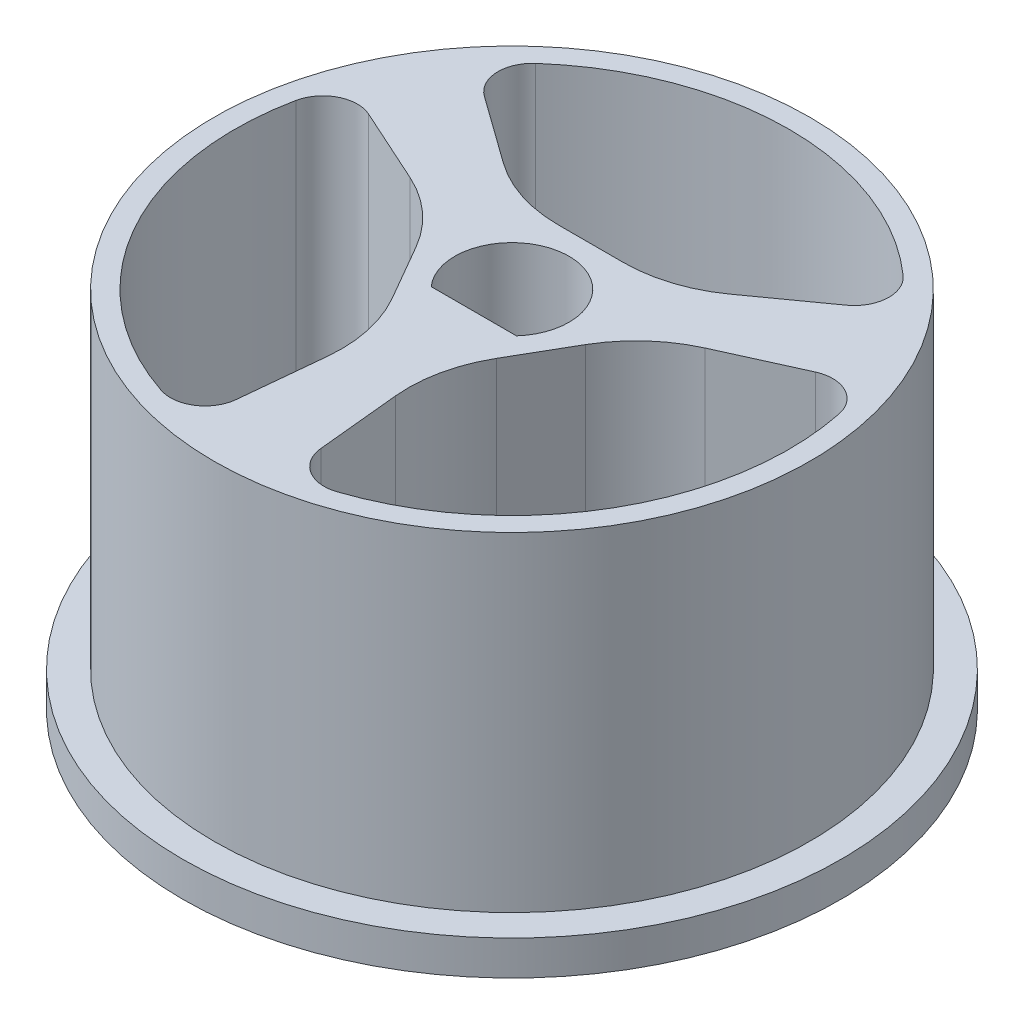
ISO-10303-21;
HEADER;
FILE_DESCRIPTION(('STEP AP214'),'2;1');
FILE_NAME('part.step','',(''),(''),'','','');
FILE_SCHEMA(('AUTOMOTIVE_DESIGN { 1 0 10303 214 1 1 1 1 }'));
ENDSEC;
DATA;
#1=APPLICATION_CONTEXT('core data for automotive mechanical design processes');
#2=APPLICATION_PROTOCOL_DEFINITION('international standard','automotive_design',2000,#1);
#3=PRODUCT_CONTEXT('',#1,'mechanical');
#4=PRODUCT('Part','Part','',(#3));
#5=PRODUCT_RELATED_PRODUCT_CATEGORY('part','',(#4));
#6=PRODUCT_DEFINITION_FORMATION('','',#4);
#7=PRODUCT_DEFINITION_CONTEXT('part definition',#1,'design');
#8=PRODUCT_DEFINITION('design','',#6,#7);
#9=PRODUCT_DEFINITION_SHAPE('','',#8);
#10=(LENGTH_UNIT() NAMED_UNIT(*) SI_UNIT(.MILLI.,.METRE.));
#11=(NAMED_UNIT(*) PLANE_ANGLE_UNIT() SI_UNIT($,.RADIAN.));
#12=(NAMED_UNIT(*) SI_UNIT($,.STERADIAN.) SOLID_ANGLE_UNIT());
#13=UNCERTAINTY_MEASURE_WITH_UNIT(LENGTH_MEASURE(1.E-05),#10,'distance_accuracy_value','');
#14=(GEOMETRIC_REPRESENTATION_CONTEXT(3) GLOBAL_UNCERTAINTY_ASSIGNED_CONTEXT((#13)) GLOBAL_UNIT_ASSIGNED_CONTEXT((#10,
#11,#12)) REPRESENTATION_CONTEXT('',''));
#15=CARTESIAN_POINT('',(0.,0.,0.));
#16=DIRECTION('',(0.,0.,1.));
#17=DIRECTION('',(1.,0.,0.));
#18=AXIS2_PLACEMENT_3D('',#15,#16,#17);
#19=CARTESIAN_POINT('',(0.,1.,0.));
#20=DIRECTION('',(0.,-1.,0.));
#21=DIRECTION('',(0.,0.,-1.));
#22=AXIS2_PLACEMENT_3D('',#19,#20,#21);
#23=CYLINDRICAL_SURFACE('',#22,9.5);
#24=CARTESIAN_POINT('',(0.,1.,0.));
#25=DIRECTION('',(0.,1.,0.));
#26=DIRECTION('',(0.,0.,1.));
#27=AXIS2_PLACEMENT_3D('',#24,#25,#26);
#28=CIRCLE('',#27,9.5);
#29=CARTESIAN_POINT('',(0.,1.,9.5));
#30=VERTEX_POINT('',#29);
#31=EDGE_CURVE('E11',#30,#30,#28,.T.);
#32=ORIENTED_EDGE('',*,*,#31,.F.);
#33=EDGE_LOOP('',(#32));
#34=FACE_BOUND('',#33,.T.);
#35=CARTESIAN_POINT('',(0.,0.,0.));
#36=DIRECTION('',(0.,1.,0.));
#37=DIRECTION('',(0.,0.,1.));
#38=AXIS2_PLACEMENT_3D('',#35,#36,#37);
#39=CIRCLE('',#38,9.5);
#40=CARTESIAN_POINT('',(0.,0.,9.5));
#41=VERTEX_POINT('',#40);
#42=EDGE_CURVE('E39',#41,#41,#39,.T.);
#43=ORIENTED_EDGE('',*,*,#42,.T.);
#44=EDGE_LOOP('',(#43));
#45=FACE_BOUND('',#44,.T.);
#46=ADVANCED_FACE('F36',(#34,#45),#23,.T.);
#47=CARTESIAN_POINT('',(0.,1.,0.));
#48=DIRECTION('',(0.,1.,0.));
#49=DIRECTION('',(0.,0.,1.));
#50=AXIS2_PLACEMENT_3D('',#47,#48,#49);
#51=PLANE('',#50);
#52=CARTESIAN_POINT('',(0.,1.,0.));
#53=DIRECTION('',(0.,1.,0.));
#54=DIRECTION('',(0.,0.,1.));
#55=AXIS2_PLACEMENT_3D('',#52,#53,#54);
#56=CIRCLE('',#55,8.6);
#57=CARTESIAN_POINT('',(0.,1.,8.6));
#58=VERTEX_POINT('',#57);
#59=EDGE_CURVE('E45',#58,#58,#56,.T.);
#60=ORIENTED_EDGE('',*,*,#59,.F.);
#61=EDGE_LOOP('',(#60));
#62=FACE_BOUND('',#61,.T.);
#63=ORIENTED_EDGE('',*,*,#31,.T.);
#64=EDGE_LOOP('',(#63));
#65=FACE_BOUND('',#64,.T.);
#66=ADVANCED_FACE('F378',(#62,#65),#51,.T.);
#67=CARTESIAN_POINT('',(0.,0.,0.));
#68=DIRECTION('',(0.,1.,0.));
#69=DIRECTION('',(0.,0.,1.));
#70=AXIS2_PLACEMENT_3D('',#67,#68,#69);
#71=PLANE('',#70);
#72=ORIENTED_EDGE('',*,*,#42,.F.);
#73=EDGE_LOOP('',(#72));
#74=FACE_BOUND('',#73,.T.);
#75=CARTESIAN_POINT('',(-6.85870435304279,0.,-1.39934791869351));
#76=DIRECTION('',(0.,1.,0.));
#77=DIRECTION('',(0.,0.,1.));
#78=AXIS2_PLACEMENT_3D('',#75,#76,#77);
#79=CIRCLE('',#78,1.);
#80=CARTESIAN_POINT('',(-6.44644112269958,0.,-2.3104126962516));
#81=VERTEX_POINT('',#80);
#82=CARTESIAN_POINT('',(-7.83851926062033,0.,-1.59925476422115));
#83=VERTEX_POINT('',#82);
#84=EDGE_CURVE('E245',#81,#83,#79,.T.);
#85=ORIENTED_EDGE('',*,*,#84,.T.);
#86=CARTESIAN_POINT('',(0.,0.,0.));
#87=DIRECTION('',(0.,1.,0.));
#88=DIRECTION('',(0.,0.,1.));
#89=AXIS2_PLACEMENT_3D('',#86,#87,#88);
#90=CIRCLE('',#89,8.);
#91=CARTESIAN_POINT('',(-2.53426437737135,0.,7.5879841898614));
#92=VERTEX_POINT('',#91);
#93=EDGE_CURVE('E264',#83,#92,#90,.T.);
#94=ORIENTED_EDGE('',*,*,#93,.T.);
#95=CARTESIAN_POINT('',(-2.21748133019993,0.,6.63948616612873));
#96=DIRECTION('',(0.,1.,0.));
#97=DIRECTION('',(0.,0.,1.));
#98=AXIS2_PLACEMENT_3D('',#95,#96,#97);
#99=CIRCLE('',#98,1.);
#100=CARTESIAN_POINT('',(-1.2223444731698,0.,6.73798812438431));
#101=VERTEX_POINT('',#100);
#102=EDGE_CURVE('E261',#101,#92,#99,.F.);
#103=ORIENTED_EDGE('',*,*,#102,.F.);
#104=DIRECTION('',(-0.0985019582555868,0.,0.995136857030135));
#105=VECTOR('',#104,1.);
#106=CARTESIAN_POINT('',(-0.550007177420138,0.,-0.0544415410280307));
#107=LINE('',#106,#105);
#108=CARTESIAN_POINT('',(-0.985685010378247,0.,4.34708587066728));
#109=VERTEX_POINT('',#108);
#110=EDGE_CURVE('E259',#109,#101,#107,.T.);
#111=ORIENTED_EDGE('',*,*,#110,.F.);
#112=CARTESIAN_POINT('',(-4.96623243849878,0.,3.95307803764491));
#113=DIRECTION('',(0.,1.,0.));
#114=DIRECTION('',(0.,0.,1.));
#115=AXIS2_PLACEMENT_3D('',#112,#113,#114);
#116=CIRCLE('',#115,3.99999999999999);
#117=CARTESIAN_POINT('',(-1.50213082336102,0.,1.95307803764498));
#118=VERTEX_POINT('',#117);
#119=EDGE_CURVE('E256',#109,#118,#116,.T.);
#120=ORIENTED_EDGE('',*,*,#119,.T.);
#121=DIRECTION('',(0.499999999999987,0.,0.866025403784446));
#122=VECTOR('',#121,1.);
#123=CARTESIAN_POINT('',(-1.97230571560778,0.,1.13871123583035));
#124=LINE('',#123,#122);
#125=CARTESIAN_POINT('',(-2.44248060785444,0.,0.324344434015888));
#126=VERTEX_POINT('',#125);
#127=EDGE_CURVE('E253',#126,#118,#124,.T.);
#128=ORIENTED_EDGE('',*,*,#127,.F.);
#129=CARTESIAN_POINT('',(-5.90658222299222,0.,2.32434443401583));
#130=DIRECTION('',(0.,1.,0.));
#131=DIRECTION('',(0.,0.,1.));
#132=AXIS2_PLACEMENT_3D('',#129,#130,#131);
#133=CIRCLE('',#132,4.);
#134=CARTESIAN_POINT('',(-4.25752930161938,0.,-1.31991467621655));
#135=VERTEX_POINT('',#134);
#136=EDGE_CURVE('E251',#135,#126,#133,.F.);
#137=ORIENTED_EDGE('',*,*,#136,.F.);
#138=DIRECTION('',(-0.911064777558094,0.,-0.412263230343214));
#139=VECTOR('',#138,1.);
#140=CARTESIAN_POINT('',(-0.22785583115862,0.,0.503540958423628));
#141=LINE('',#140,#139);
#142=EDGE_CURVE('E248',#135,#81,#141,.T.);
#143=ORIENTED_EDGE('',*,*,#142,.T.);
#144=EDGE_LOOP('',(#85,#94,#103,#111,#120,#128,#137,#143));
#145=FACE_BOUND('',#144,.T.);
#146=CARTESIAN_POINT('',(0.,0.,0.));
#147=DIRECTION('',(0.,1.,0.));
#148=DIRECTION('',(0.,0.,1.));
#149=AXIS2_PLACEMENT_3D('',#146,#147,#148);
#150=CIRCLE('',#149,1.65);
#151=CARTESIAN_POINT('',(1.22983738762488,0.,1.1));
#152=VERTEX_POINT('',#151);
#153=CARTESIAN_POINT('',(-1.22983738762488,0.,1.1));
#154=VERTEX_POINT('',#153);
#155=EDGE_CURVE('E267',#152,#154,#150,.T.);
#156=ORIENTED_EDGE('',*,*,#155,.T.);
#157=DIRECTION('',(1.,0.,0.));
#158=VECTOR('',#157,1.);
#159=CARTESIAN_POINT('',(0.,0.,1.1));
#160=LINE('',#159,#158);
#161=EDGE_CURVE('E270',#154,#152,#160,.T.);
#162=ORIENTED_EDGE('',*,*,#161,.T.);
#163=EDGE_LOOP('',(#156,#162));
#164=FACE_BOUND('',#163,.T.);
#165=DIRECTION('',(-0.812562819302513,0.,-0.582873626686911));
#166=VECTOR('',#165,1.);
#167=CARTESIAN_POINT('',(0.322151346261551,0.,-0.449099417395658));
#168=LINE('',#167,#166);
#169=CARTESIAN_POINT('',(-3.27184429124112,0.,-3.02717119445074));
#170=VERTEX_POINT('',#169);
#171=CARTESIAN_POINT('',(-5.22409664952978,0.,-4.4275754281327));
#172=VERTEX_POINT('',#171);
#173=EDGE_CURVE('E273',#170,#172,#168,.T.);
#174=ORIENTED_EDGE('',*,*,#173,.F.);
#175=CARTESIAN_POINT('',(-0.940349784493413,0.,-6.27742247166075));
#176=DIRECTION('',(0.,1.,0.));
#177=DIRECTION('',(0.,0.,1.));
#178=AXIS2_PLACEMENT_3D('',#175,#176,#177);
#179=CIRCLE('',#178,4.);
#180=CARTESIAN_POINT('',(-0.940349784493415,0.,-2.27742247166075));
#181=VERTEX_POINT('',#180);
#182=EDGE_CURVE('E293',#170,#181,#179,.T.);
#183=ORIENTED_EDGE('',*,*,#182,.T.);
#184=DIRECTION('',(-1.,0.,0.));
#185=VECTOR('',#184,1.);
#186=CARTESIAN_POINT('',(0.,0.,-2.27742247166075));
#187=LINE('',#186,#185);
#188=CARTESIAN_POINT('',(0.940349784493433,0.,-2.27742247166074));
#189=VERTEX_POINT('',#188);
#190=EDGE_CURVE('E290',#189,#181,#187,.T.);
#191=ORIENTED_EDGE('',*,*,#190,.F.);
#192=CARTESIAN_POINT('',(0.940349784493465,0.,-6.27742247166074));
#193=DIRECTION('',(0.,1.,0.));
#194=DIRECTION('',(0.,0.,1.));
#195=AXIS2_PLACEMENT_3D('',#192,#193,#194);
#196=CIRCLE('',#195,4.);
#197=CARTESIAN_POINT('',(3.27184429124115,0.,-3.02717119445072));
#198=VERTEX_POINT('',#197);
#199=EDGE_CURVE('E288',#198,#189,#196,.F.);
#200=ORIENTED_EDGE('',*,*,#199,.F.);
#201=DIRECTION('',(0.812562819302502,0.,-0.582873626686926));
#202=VECTOR('',#201,1.);
#203=CARTESIAN_POINT('',(-0.32215134626149,0.,-0.449099417395555));
#204=LINE('',#203,#202);
#205=CARTESIAN_POINT('',(5.22409664952978,0.,-4.42757542813271));
#206=VERTEX_POINT('',#205);
#207=EDGE_CURVE('E285',#198,#206,#204,.T.);
#208=ORIENTED_EDGE('',*,*,#207,.T.);
#209=CARTESIAN_POINT('',(4.64122302284286,0.,-5.24013824743521));
#210=DIRECTION('',(0.,1.,0.));
#211=DIRECTION('',(0.,0.,1.));
#212=AXIS2_PLACEMENT_3D('',#209,#210,#211);
#213=CIRCLE('',#212,1.);
#214=CARTESIAN_POINT('',(5.30425488324898,0.,-5.98872942564025));
#215=VERTEX_POINT('',#214);
#216=EDGE_CURVE('E282',#206,#215,#213,.T.);
#217=ORIENTED_EDGE('',*,*,#216,.T.);
#218=CARTESIAN_POINT('',(0.,0.,0.));
#219=DIRECTION('',(0.,1.,0.));
#220=DIRECTION('',(0.,0.,1.));
#221=AXIS2_PLACEMENT_3D('',#218,#219,#220);
#222=CIRCLE('',#221,8.);
#223=CARTESIAN_POINT('',(-5.30425488324898,0.,-5.98872942564024));
#224=VERTEX_POINT('',#223);
#225=EDGE_CURVE('E279',#215,#224,#222,.T.);
#226=ORIENTED_EDGE('',*,*,#225,.T.);
#227=CARTESIAN_POINT('',(-4.64122302284286,0.,-5.24013824743521));
#228=DIRECTION('',(0.,1.,0.));
#229=DIRECTION('',(0.,0.,1.));
#230=AXIS2_PLACEMENT_3D('',#227,#228,#229);
#231=CIRCLE('',#230,1.);
#232=EDGE_CURVE('E276',#172,#224,#231,.F.);
#233=ORIENTED_EDGE('',*,*,#232,.F.);
#234=EDGE_LOOP('',(#174,#183,#191,#200,#208,#217,#226,#233));
#235=FACE_BOUND('',#234,.T.);
#236=DIRECTION('',(0.0985019582555872,0.,0.995136857030135));
#237=VECTOR('',#236,1.);
#238=CARTESIAN_POINT('',(0.550007177420137,0.,-0.0544415410280308));
#239=LINE('',#238,#237);
#240=CARTESIAN_POINT('',(0.985685010378247,0.,4.34708587066728));
#241=VERTEX_POINT('',#240);
#242=CARTESIAN_POINT('',(1.2223444731698,0.,6.73798812438431));
#243=VERTEX_POINT('',#242);
#244=EDGE_CURVE('E296',#241,#243,#239,.T.);
#245=ORIENTED_EDGE('',*,*,#244,.T.);
#246=CARTESIAN_POINT('',(2.21748133019993,0.,6.63948616612873));
#247=DIRECTION('',(0.,1.,0.));
#248=DIRECTION('',(0.,0.,1.));
#249=AXIS2_PLACEMENT_3D('',#246,#247,#248);
#250=CIRCLE('',#249,1.);
#251=CARTESIAN_POINT('',(2.53426437737135,0.,7.5879841898614));
#252=VERTEX_POINT('',#251);
#253=EDGE_CURVE('E313',#243,#252,#250,.T.);
#254=ORIENTED_EDGE('',*,*,#253,.T.);
#255=CARTESIAN_POINT('',(0.,0.,0.));
#256=DIRECTION('',(0.,1.,0.));
#257=DIRECTION('',(0.,0.,1.));
#258=AXIS2_PLACEMENT_3D('',#255,#256,#257);
#259=CIRCLE('',#258,8.);
#260=CARTESIAN_POINT('',(7.83851926062033,0.,-1.59925476422116));
#261=VERTEX_POINT('',#260);
#262=EDGE_CURVE('E311',#252,#261,#259,.T.);
#263=ORIENTED_EDGE('',*,*,#262,.T.);
#264=CARTESIAN_POINT('',(6.85870435304279,0.,-1.39934791869351));
#265=DIRECTION('',(0.,1.,0.));
#266=DIRECTION('',(0.,0.,1.));
#267=AXIS2_PLACEMENT_3D('',#264,#265,#266);
#268=CIRCLE('',#267,1.);
#269=CARTESIAN_POINT('',(6.44644112269958,0.,-2.31041269625161));
#270=VERTEX_POINT('',#269);
#271=EDGE_CURVE('E233',#270,#261,#268,.F.);
#272=ORIENTED_EDGE('',*,*,#271,.F.);
#273=DIRECTION('',(0.911064777558086,0.,-0.412263230343231));
#274=VECTOR('',#273,1.);
#275=CARTESIAN_POINT('',(0.227855831158679,0.,0.503540958423733));
#276=LINE('',#275,#274);
#277=CARTESIAN_POINT('',(4.25752930161939,0.,-1.31991467621651));
#278=VERTEX_POINT('',#277);
#279=EDGE_CURVE('E307',#278,#270,#276,.T.);
#280=ORIENTED_EDGE('',*,*,#279,.F.);
#281=CARTESIAN_POINT('',(5.9065822229922,0.,2.32434443401588));
#282=DIRECTION('',(0.,1.,0.));
#283=DIRECTION('',(0.,0.,1.));
#284=AXIS2_PLACEMENT_3D('',#281,#282,#283);
#285=CIRCLE('',#284,4.);
#286=CARTESIAN_POINT('',(2.44248060785446,0.,0.324344434015867));
#287=VERTEX_POINT('',#286);
#288=EDGE_CURVE('E304',#278,#287,#285,.T.);
#289=ORIENTED_EDGE('',*,*,#288,.T.);
#290=DIRECTION('',(0.500000000000008,0.,-0.866025403784434));
#291=VECTOR('',#290,1.);
#292=CARTESIAN_POINT('',(1.97230571560774,0.,1.13871123583039));
#293=LINE('',#292,#291);
#294=CARTESIAN_POINT('',(1.50213082336102,0.,1.95307803764491));
#295=VERTEX_POINT('',#294);
#296=EDGE_CURVE('E301',#295,#287,#293,.T.);
#297=ORIENTED_EDGE('',*,*,#296,.F.);
#298=CARTESIAN_POINT('',(4.96623243849875,0.,3.95307803764496));
#299=DIRECTION('',(0.,1.,0.));
#300=DIRECTION('',(0.,0.,1.));
#301=AXIS2_PLACEMENT_3D('',#298,#299,#300);
#302=CIRCLE('',#301,3.99999999999998);
#303=EDGE_CURVE('E298',#241,#295,#302,.F.);
#304=ORIENTED_EDGE('',*,*,#303,.F.);
#305=EDGE_LOOP('',(#245,#254,#263,#272,#280,#289,#297,#304));
#306=FACE_BOUND('',#305,.T.);
#307=ADVANCED_FACE('F374',(#74,#145,#164,#235,#306),#71,.F.);
#308=CARTESIAN_POINT('',(0.550007177420137,10.5,-0.0544415410280308));
#309=DIRECTION('',(0.995136857030135,0.,-0.0985019582555872));
#310=DIRECTION('',(-0.0985019582555872,0.,-0.995136857030135));
#311=AXIS2_PLACEMENT_3D('',#308,#309,#310);
#312=PLANE('',#311);
#313=ORIENTED_EDGE('',*,*,#244,.F.);
#314=DIRECTION('',(0.,-1.,0.));
#315=VECTOR('',#314,1.);
#316=CARTESIAN_POINT('',(0.985685010378247,10.5,4.34708587066728));
#317=LINE('',#316,#315);
#318=CARTESIAN_POINT('',(0.985685010378247,10.5,4.34708587066728));
#319=VERTEX_POINT('',#318);
#320=EDGE_CURVE('E328',#319,#241,#317,.T.);
#321=ORIENTED_EDGE('',*,*,#320,.F.);
#322=DIRECTION('',(0.0985019582555872,0.,0.995136857030135));
#323=VECTOR('',#322,1.);
#324=CARTESIAN_POINT('',(0.550007177420137,10.5,-0.0544415410280308));
#325=LINE('',#324,#323);
#326=CARTESIAN_POINT('',(1.2223444731698,10.5,6.73798812438431));
#327=VERTEX_POINT('',#326);
#328=EDGE_CURVE('E714',#319,#327,#325,.T.);
#329=ORIENTED_EDGE('',*,*,#328,.T.);
#330=DIRECTION('',(0.,-1.,0.));
#331=VECTOR('',#330,1.);
#332=CARTESIAN_POINT('',(1.2223444731698,10.5,6.73798812438431));
#333=LINE('',#332,#331);
#334=EDGE_CURVE('E53',#327,#243,#333,.T.);
#335=ORIENTED_EDGE('',*,*,#334,.T.);
#336=EDGE_LOOP('',(#313,#321,#329,#335));
#337=FACE_BOUND('',#336,.T.);
#338=ADVANCED_FACE('F377',(#337),#312,.T.);
#339=CARTESIAN_POINT('',(4.96623243849875,10.5,3.95307803764496));
#340=DIRECTION('',(0.,-1.,0.));
#341=DIRECTION('',(0.,0.,-1.));
#342=AXIS2_PLACEMENT_3D('',#339,#340,#341);
#343=CYLINDRICAL_SURFACE('',#342,3.99999999999998);
#344=ORIENTED_EDGE('',*,*,#303,.T.);
#345=DIRECTION('',(0.,-1.,0.));
#346=VECTOR('',#345,1.);
#347=CARTESIAN_POINT('',(1.50213082336102,10.5,1.95307803764491));
#348=LINE('',#347,#346);
#349=CARTESIAN_POINT('',(1.50213082336102,10.5,1.95307803764491));
#350=VERTEX_POINT('',#349);
#351=EDGE_CURVE('E325',#350,#295,#348,.T.);
#352=ORIENTED_EDGE('',*,*,#351,.F.);
#353=CARTESIAN_POINT('',(4.96623243849875,10.5,3.95307803764496));
#354=DIRECTION('',(0.,1.,0.));
#355=DIRECTION('',(0.,0.,1.));
#356=AXIS2_PLACEMENT_3D('',#353,#354,#355);
#357=CIRCLE('',#356,3.99999999999998);
#358=EDGE_CURVE('E713',#319,#350,#357,.F.);
#359=ORIENTED_EDGE('',*,*,#358,.F.);
#360=ORIENTED_EDGE('',*,*,#320,.T.);
#361=EDGE_LOOP('',(#344,#352,#359,#360));
#362=FACE_BOUND('',#361,.T.);
#363=ADVANCED_FACE('F485',(#362),#343,.F.);
#364=CARTESIAN_POINT('',(1.97230571560774,10.5,1.13871123583039));
#365=DIRECTION('',(-0.866025403784434,0.,-0.500000000000008));
#366=DIRECTION('',(-0.500000000000008,0.,0.866025403784434));
#367=AXIS2_PLACEMENT_3D('',#364,#365,#366);
#368=PLANE('',#367);
#369=ORIENTED_EDGE('',*,*,#296,.T.);
#370=DIRECTION('',(0.,-1.,0.));
#371=VECTOR('',#370,1.);
#372=CARTESIAN_POINT('',(2.44248060785446,10.5,0.324344434015867));
#373=LINE('',#372,#371);
#374=CARTESIAN_POINT('',(2.44248060785446,10.5,0.324344434015867));
#375=VERTEX_POINT('',#374);
#376=EDGE_CURVE('E323',#375,#287,#373,.T.);
#377=ORIENTED_EDGE('',*,*,#376,.F.);
#378=DIRECTION('',(0.500000000000008,0.,-0.866025403784434));
#379=VECTOR('',#378,1.);
#380=CARTESIAN_POINT('',(1.97230571560774,10.5,1.13871123583039));
#381=LINE('',#380,#379);
#382=EDGE_CURVE('E710',#350,#375,#381,.T.);
#383=ORIENTED_EDGE('',*,*,#382,.F.);
#384=ORIENTED_EDGE('',*,*,#351,.T.);
#385=EDGE_LOOP('',(#369,#377,#383,#384));
#386=FACE_BOUND('',#385,.T.);
#387=ADVANCED_FACE('F488',(#386),#368,.F.);
#388=CARTESIAN_POINT('',(5.9065822229922,10.5,2.32434443401588));
#389=DIRECTION('',(0.,-1.,0.));
#390=DIRECTION('',(0.,0.,-1.));
#391=AXIS2_PLACEMENT_3D('',#388,#389,#390);
#392=CYLINDRICAL_SURFACE('',#391,4.);
#393=ORIENTED_EDGE('',*,*,#288,.F.);
#394=DIRECTION('',(0.,-1.,0.));
#395=VECTOR('',#394,1.);
#396=CARTESIAN_POINT('',(4.25752930161939,10.5,-1.31991467621651));
#397=LINE('',#396,#395);
#398=CARTESIAN_POINT('',(4.25752930161939,10.5,-1.31991467621651));
#399=VERTEX_POINT('',#398);
#400=EDGE_CURVE('E321',#399,#278,#397,.T.);
#401=ORIENTED_EDGE('',*,*,#400,.F.);
#402=CARTESIAN_POINT('',(5.9065822229922,10.5,2.32434443401588));
#403=DIRECTION('',(0.,1.,0.));
#404=DIRECTION('',(0.,0.,1.));
#405=AXIS2_PLACEMENT_3D('',#402,#403,#404);
#406=CIRCLE('',#405,4.);
#407=EDGE_CURVE('E708',#399,#375,#406,.T.);
#408=ORIENTED_EDGE('',*,*,#407,.T.);
#409=ORIENTED_EDGE('',*,*,#376,.T.);
#410=EDGE_LOOP('',(#393,#401,#408,#409));
#411=FACE_BOUND('',#410,.T.);
#412=ADVANCED_FACE('F492',(#411),#392,.F.);
#413=CARTESIAN_POINT('',(0.227855831158679,10.5,0.503540958423733));
#414=DIRECTION('',(-0.41226323034323,0.,-0.911064777558086));
#415=DIRECTION('',(-0.911064777558086,0.,0.41226323034323));
#416=AXIS2_PLACEMENT_3D('',#413,#414,#415);
#417=PLANE('',#416);
#418=ORIENTED_EDGE('',*,*,#279,.T.);
#419=DIRECTION('',(0.,-1.,0.));
#420=VECTOR('',#419,1.);
#421=CARTESIAN_POINT('',(6.44644112269958,10.5,-2.31041269625161));
#422=LINE('',#421,#420);
#423=CARTESIAN_POINT('',(6.44644112269958,10.5,-2.31041269625161));
#424=VERTEX_POINT('',#423);
#425=EDGE_CURVE('E236',#424,#270,#422,.T.);
#426=ORIENTED_EDGE('',*,*,#425,.F.);
#427=DIRECTION('',(0.911064777558086,0.,-0.412263230343231));
#428=VECTOR('',#427,1.);
#429=CARTESIAN_POINT('',(0.227855831158679,10.5,0.503540958423733));
#430=LINE('',#429,#428);
#431=EDGE_CURVE('E225',#399,#424,#430,.T.);
#432=ORIENTED_EDGE('',*,*,#431,.F.);
#433=ORIENTED_EDGE('',*,*,#400,.T.);
#434=EDGE_LOOP('',(#418,#426,#432,#433));
#435=FACE_BOUND('',#434,.T.);
#436=ADVANCED_FACE('F496',(#435),#417,.F.);
#437=CARTESIAN_POINT('',(6.85870435304279,10.5,-1.39934791869351));
#438=DIRECTION('',(0.,-1.,0.));
#439=DIRECTION('',(0.,0.,-1.));
#440=AXIS2_PLACEMENT_3D('',#437,#438,#439);
#441=CYLINDRICAL_SURFACE('',#440,1.);
#442=ORIENTED_EDGE('',*,*,#271,.T.);
#443=DIRECTION('',(0.,-1.,0.));
#444=VECTOR('',#443,1.);
#445=CARTESIAN_POINT('',(7.83851926062033,10.5,-1.59925476422116));
#446=LINE('',#445,#444);
#447=CARTESIAN_POINT('',(7.83851926062033,10.5,-1.59925476422116));
#448=VERTEX_POINT('',#447);
#449=EDGE_CURVE('E231',#448,#261,#446,.T.);
#450=ORIENTED_EDGE('',*,*,#449,.F.);
#451=CARTESIAN_POINT('',(6.85870435304279,10.5,-1.39934791869351));
#452=DIRECTION('',(0.,1.,0.));
#453=DIRECTION('',(0.,0.,1.));
#454=AXIS2_PLACEMENT_3D('',#451,#452,#453);
#455=CIRCLE('',#454,1.);
#456=EDGE_CURVE('E216',#424,#448,#455,.F.);
#457=ORIENTED_EDGE('',*,*,#456,.F.);
#458=ORIENTED_EDGE('',*,*,#425,.T.);
#459=EDGE_LOOP('',(#442,#450,#457,#458));
#460=FACE_BOUND('',#459,.T.);
#461=ADVANCED_FACE('F232',(#460),#441,.F.);
#462=CARTESIAN_POINT('',(0.,10.5,0.));
#463=DIRECTION('',(0.,-1.,0.));
#464=DIRECTION('',(0.,0.,-1.));
#465=AXIS2_PLACEMENT_3D('',#462,#463,#464);
#466=CYLINDRICAL_SURFACE('',#465,8.);
#467=ORIENTED_EDGE('',*,*,#262,.F.);
#468=DIRECTION('',(0.,-1.,0.));
#469=VECTOR('',#468,1.);
#470=CARTESIAN_POINT('',(2.53426437737135,10.5,7.5879841898614));
#471=LINE('',#470,#469);
#472=CARTESIAN_POINT('',(2.53426437737135,10.5,7.5879841898614));
#473=VERTEX_POINT('',#472);
#474=EDGE_CURVE('E133',#473,#252,#471,.T.);
#475=ORIENTED_EDGE('',*,*,#474,.F.);
#476=CARTESIAN_POINT('',(0.,10.5,0.));
#477=DIRECTION('',(0.,1.,0.));
#478=DIRECTION('',(0.,0.,1.));
#479=AXIS2_PLACEMENT_3D('',#476,#477,#478);
#480=CIRCLE('',#479,8.);
#481=EDGE_CURVE('E222',#473,#448,#480,.T.);
#482=ORIENTED_EDGE('',*,*,#481,.T.);
#483=ORIENTED_EDGE('',*,*,#449,.T.);
#484=EDGE_LOOP('',(#467,#475,#482,#483));
#485=FACE_BOUND('',#484,.T.);
#486=ADVANCED_FACE('F238',(#485),#466,.F.);
#487=CARTESIAN_POINT('',(0.322151346261551,10.5,-0.449099417395658));
#488=DIRECTION('',(-0.582873626686911,0.,0.812562819302512));
#489=DIRECTION('',(0.812562819302513,0.,0.582873626686911));
#490=AXIS2_PLACEMENT_3D('',#487,#488,#489);
#491=PLANE('',#490);
#492=ORIENTED_EDGE('',*,*,#173,.T.);
#493=DIRECTION('',(0.,-1.,0.));
#494=VECTOR('',#493,1.);
#495=CARTESIAN_POINT('',(-5.22409664952978,10.5,-4.4275754281327));
#496=LINE('',#495,#494);
#497=CARTESIAN_POINT('',(-5.22409664952978,10.5,-4.4275754281327));
#498=VERTEX_POINT('',#497);
#499=EDGE_CURVE('E318',#498,#172,#496,.T.);
#500=ORIENTED_EDGE('',*,*,#499,.F.);
#501=DIRECTION('',(-0.812562819302513,0.,-0.582873626686911));
#502=VECTOR('',#501,1.);
#503=CARTESIAN_POINT('',(0.322151346261551,10.5,-0.449099417395658));
#504=LINE('',#503,#502);
#505=CARTESIAN_POINT('',(-3.27184429124112,10.5,-3.02717119445074));
#506=VERTEX_POINT('',#505);
#507=EDGE_CURVE('E738',#506,#498,#504,.T.);
#508=ORIENTED_EDGE('',*,*,#507,.F.);
#509=DIRECTION('',(0.,-1.,0.));
#510=VECTOR('',#509,1.);
#511=CARTESIAN_POINT('',(-3.27184429124112,10.5,-3.02717119445074));
#512=LINE('',#511,#510);
#513=EDGE_CURVE('E330',#506,#170,#512,.T.);
#514=ORIENTED_EDGE('',*,*,#513,.T.);
#515=EDGE_LOOP('',(#492,#500,#508,#514));
#516=FACE_BOUND('',#515,.T.);
#517=ADVANCED_FACE('F453',(#516),#491,.F.);
#518=CARTESIAN_POINT('',(-4.64122302284286,10.5,-5.24013824743521));
#519=DIRECTION('',(0.,-1.,0.));
#520=DIRECTION('',(0.,0.,-1.));
#521=AXIS2_PLACEMENT_3D('',#518,#519,#520);
#522=CYLINDRICAL_SURFACE('',#521,1.);
#523=ORIENTED_EDGE('',*,*,#232,.T.);
#524=DIRECTION('',(0.,-1.,0.));
#525=VECTOR('',#524,1.);
#526=CARTESIAN_POINT('',(-5.30425488324898,10.5,-5.98872942564024));
#527=LINE('',#526,#525);
#528=CARTESIAN_POINT('',(-5.30425488324898,10.5,-5.98872942564024));
#529=VERTEX_POINT('',#528);
#530=EDGE_CURVE('E344',#529,#224,#527,.T.);
#531=ORIENTED_EDGE('',*,*,#530,.F.);
#532=CARTESIAN_POINT('',(-4.64122302284286,10.5,-5.24013824743521));
#533=DIRECTION('',(0.,1.,0.));
#534=DIRECTION('',(0.,0.,1.));
#535=AXIS2_PLACEMENT_3D('',#532,#533,#534);
#536=CIRCLE('',#535,1.);
#537=EDGE_CURVE('E736',#498,#529,#536,.F.);
#538=ORIENTED_EDGE('',*,*,#537,.F.);
#539=ORIENTED_EDGE('',*,*,#499,.T.);
#540=EDGE_LOOP('',(#523,#531,#538,#539));
#541=FACE_BOUND('',#540,.T.);
#542=ADVANCED_FACE('F456',(#541),#522,.F.);
#543=CARTESIAN_POINT('',(0.,10.5,0.));
#544=DIRECTION('',(0.,-1.,0.));
#545=DIRECTION('',(0.,0.,-1.));
#546=AXIS2_PLACEMENT_3D('',#543,#544,#545);
#547=CYLINDRICAL_SURFACE('',#546,8.);
#548=ORIENTED_EDGE('',*,*,#225,.F.);
#549=DIRECTION('',(0.,-1.,0.));
#550=VECTOR('',#549,1.);
#551=CARTESIAN_POINT('',(5.30425488324898,10.5,-5.98872942564025));
#552=LINE('',#551,#550);
#553=CARTESIAN_POINT('',(5.30425488324898,10.5,-5.98872942564025));
#554=VERTEX_POINT('',#553);
#555=EDGE_CURVE('E342',#554,#215,#552,.T.);
#556=ORIENTED_EDGE('',*,*,#555,.F.);
#557=CARTESIAN_POINT('',(0.,10.5,0.));
#558=DIRECTION('',(0.,1.,0.));
#559=DIRECTION('',(0.,0.,1.));
#560=AXIS2_PLACEMENT_3D('',#557,#558,#559);
#561=CIRCLE('',#560,8.);
#562=EDGE_CURVE('E733',#554,#529,#561,.T.);
#563=ORIENTED_EDGE('',*,*,#562,.T.);
#564=ORIENTED_EDGE('',*,*,#530,.T.);
#565=EDGE_LOOP('',(#548,#556,#563,#564));
#566=FACE_BOUND('',#565,.T.);
#567=ADVANCED_FACE('F460',(#566),#547,.F.);
#568=CARTESIAN_POINT('',(4.64122302284286,10.5,-5.24013824743521));
#569=DIRECTION('',(0.,-1.,0.));
#570=DIRECTION('',(0.,0.,-1.));
#571=AXIS2_PLACEMENT_3D('',#568,#569,#570);
#572=CYLINDRICAL_SURFACE('',#571,1.);
#573=ORIENTED_EDGE('',*,*,#216,.F.);
#574=DIRECTION('',(0.,-1.,0.));
#575=VECTOR('',#574,1.);
#576=CARTESIAN_POINT('',(5.22409664952978,10.5,-4.42757542813271));
#577=LINE('',#576,#575);
#578=CARTESIAN_POINT('',(5.22409664952978,10.5,-4.42757542813271));
#579=VERTEX_POINT('',#578);
#580=EDGE_CURVE('E340',#579,#206,#577,.T.);
#581=ORIENTED_EDGE('',*,*,#580,.F.);
#582=CARTESIAN_POINT('',(4.64122302284286,10.5,-5.24013824743521));
#583=DIRECTION('',(0.,1.,0.));
#584=DIRECTION('',(0.,0.,1.));
#585=AXIS2_PLACEMENT_3D('',#582,#583,#584);
#586=CIRCLE('',#585,1.);
#587=EDGE_CURVE('E730',#579,#554,#586,.T.);
#588=ORIENTED_EDGE('',*,*,#587,.T.);
#589=ORIENTED_EDGE('',*,*,#555,.T.);
#590=EDGE_LOOP('',(#573,#581,#588,#589));
#591=FACE_BOUND('',#590,.T.);
#592=ADVANCED_FACE('F464',(#591),#572,.F.);
#593=CARTESIAN_POINT('',(-0.32215134626149,10.5,-0.449099417395555));
#594=DIRECTION('',(-0.582873626686926,0.,-0.812562819302502));
#595=DIRECTION('',(-0.812562819302502,0.,0.582873626686926));
#596=AXIS2_PLACEMENT_3D('',#593,#594,#595);
#597=PLANE('',#596);
#598=ORIENTED_EDGE('',*,*,#207,.F.);
#599=DIRECTION('',(0.,-1.,0.));
#600=VECTOR('',#599,1.);
#601=CARTESIAN_POINT('',(3.27184429124115,10.5,-3.02717119445072));
#602=LINE('',#601,#600);
#603=CARTESIAN_POINT('',(3.27184429124115,10.5,-3.02717119445072));
#604=VERTEX_POINT('',#603);
#605=EDGE_CURVE('E338',#604,#198,#602,.T.);
#606=ORIENTED_EDGE('',*,*,#605,.F.);
#607=DIRECTION('',(0.812562819302502,0.,-0.582873626686926));
#608=VECTOR('',#607,1.);
#609=CARTESIAN_POINT('',(-0.32215134626149,10.5,-0.449099417395555));
#610=LINE('',#609,#608);
#611=EDGE_CURVE('E727',#604,#579,#610,.T.);
#612=ORIENTED_EDGE('',*,*,#611,.T.);
#613=ORIENTED_EDGE('',*,*,#580,.T.);
#614=EDGE_LOOP('',(#598,#606,#612,#613));
#615=FACE_BOUND('',#614,.T.);
#616=ADVANCED_FACE('F468',(#615),#597,.T.);
#617=CARTESIAN_POINT('',(0.940349784493465,10.5,-6.27742247166074));
#618=DIRECTION('',(0.,-1.,0.));
#619=DIRECTION('',(0.,0.,-1.));
#620=AXIS2_PLACEMENT_3D('',#617,#618,#619);
#621=CYLINDRICAL_SURFACE('',#620,4.);
#622=ORIENTED_EDGE('',*,*,#199,.T.);
#623=DIRECTION('',(0.,-1.,0.));
#624=VECTOR('',#623,1.);
#625=CARTESIAN_POINT('',(0.940349784493433,10.5,-2.27742247166074));
#626=LINE('',#625,#624);
#627=CARTESIAN_POINT('',(0.940349784493433,10.5,-2.27742247166074));
#628=VERTEX_POINT('',#627);
#629=EDGE_CURVE('E335',#628,#189,#626,.T.);
#630=ORIENTED_EDGE('',*,*,#629,.F.);
#631=CARTESIAN_POINT('',(0.940349784493465,10.5,-6.27742247166074));
#632=DIRECTION('',(0.,1.,0.));
#633=DIRECTION('',(0.,0.,1.));
#634=AXIS2_PLACEMENT_3D('',#631,#632,#633);
#635=CIRCLE('',#634,4.);
#636=EDGE_CURVE('E725',#604,#628,#635,.F.);
#637=ORIENTED_EDGE('',*,*,#636,.F.);
#638=ORIENTED_EDGE('',*,*,#605,.T.);
#639=EDGE_LOOP('',(#622,#630,#637,#638));
#640=FACE_BOUND('',#639,.T.);
#641=ADVANCED_FACE('F472',(#640),#621,.F.);
#642=CARTESIAN_POINT('',(0.,10.5,-2.27742247166075));
#643=DIRECTION('',(0.,0.,1.));
#644=DIRECTION('',(1.,0.,0.));
#645=AXIS2_PLACEMENT_3D('',#642,#643,#644);
#646=PLANE('',#645);
#647=ORIENTED_EDGE('',*,*,#190,.T.);
#648=DIRECTION('',(0.,-1.,0.));
#649=VECTOR('',#648,1.);
#650=CARTESIAN_POINT('',(-0.940349784493415,10.5,-2.27742247166075));
#651=LINE('',#650,#649);
#652=CARTESIAN_POINT('',(-0.940349784493415,10.5,-2.27742247166075));
#653=VERTEX_POINT('',#652);
#654=EDGE_CURVE('E332',#653,#181,#651,.T.);
#655=ORIENTED_EDGE('',*,*,#654,.F.);
#656=DIRECTION('',(-1.,0.,0.));
#657=VECTOR('',#656,1.);
#658=CARTESIAN_POINT('',(0.,10.5,-2.27742247166075));
#659=LINE('',#658,#657);
#660=EDGE_CURVE('E719',#628,#653,#659,.T.);
#661=ORIENTED_EDGE('',*,*,#660,.F.);
#662=ORIENTED_EDGE('',*,*,#629,.T.);
#663=EDGE_LOOP('',(#647,#655,#661,#662));
#664=FACE_BOUND('',#663,.T.);
#665=ADVANCED_FACE('F445',(#664),#646,.F.);
#666=CARTESIAN_POINT('',(0.,10.5,0.));
#667=DIRECTION('',(0.,-1.,0.));
#668=DIRECTION('',(0.,0.,-1.));
#669=AXIS2_PLACEMENT_3D('',#666,#667,#668);
#670=CYLINDRICAL_SURFACE('',#669,1.65);
#671=ORIENTED_EDGE('',*,*,#155,.F.);
#672=DIRECTION('',(0.,-1.,0.));
#673=VECTOR('',#672,1.);
#674=CARTESIAN_POINT('',(1.22983738762488,10.5,1.1));
#675=LINE('',#674,#673);
#676=CARTESIAN_POINT('',(1.22983738762488,10.5,1.1));
#677=VERTEX_POINT('',#676);
#678=EDGE_CURVE('E333',#677,#152,#675,.T.);
#679=ORIENTED_EDGE('',*,*,#678,.F.);
#680=CARTESIAN_POINT('',(0.,10.5,0.));
#681=DIRECTION('',(0.,1.,0.));
#682=DIRECTION('',(0.,0.,1.));
#683=AXIS2_PLACEMENT_3D('',#680,#681,#682);
#684=CIRCLE('',#683,1.65);
#685=CARTESIAN_POINT('',(-1.22983738762488,10.5,1.1));
#686=VERTEX_POINT('',#685);
#687=EDGE_CURVE('E747',#677,#686,#684,.T.);
#688=ORIENTED_EDGE('',*,*,#687,.T.);
#689=DIRECTION('',(0.,-1.,0.));
#690=VECTOR('',#689,1.);
#691=CARTESIAN_POINT('',(-1.22983738762488,10.5,1.1));
#692=LINE('',#691,#690);
#693=EDGE_CURVE('E348',#686,#154,#692,.T.);
#694=ORIENTED_EDGE('',*,*,#693,.T.);
#695=EDGE_LOOP('',(#671,#679,#688,#694));
#696=FACE_BOUND('',#695,.T.);
#697=ADVANCED_FACE('F418',(#696),#670,.F.);
#698=CARTESIAN_POINT('',(-6.85870435304279,10.5,-1.39934791869351));
#699=DIRECTION('',(0.,-1.,0.));
#700=DIRECTION('',(0.,0.,-1.));
#701=AXIS2_PLACEMENT_3D('',#698,#699,#700);
#702=CYLINDRICAL_SURFACE('',#701,1.);
#703=ORIENTED_EDGE('',*,*,#84,.F.);
#704=DIRECTION('',(0.,-1.,0.));
#705=VECTOR('',#704,1.);
#706=CARTESIAN_POINT('',(-6.44644112269958,10.5,-2.3104126962516));
#707=LINE('',#706,#705);
#708=CARTESIAN_POINT('',(-6.44644112269958,10.5,-2.3104126962516));
#709=VERTEX_POINT('',#708);
#710=EDGE_CURVE('E145',#709,#81,#707,.T.);
#711=ORIENTED_EDGE('',*,*,#710,.F.);
#712=CARTESIAN_POINT('',(-6.85870435304279,10.5,-1.39934791869351));
#713=DIRECTION('',(0.,1.,0.));
#714=DIRECTION('',(0.,0.,1.));
#715=AXIS2_PLACEMENT_3D('',#712,#713,#714);
#716=CIRCLE('',#715,1.);
#717=CARTESIAN_POINT('',(-7.83851926062033,10.5,-1.59925476422115));
#718=VERTEX_POINT('',#717);
#719=EDGE_CURVE('E316',#709,#718,#716,.T.);
#720=ORIENTED_EDGE('',*,*,#719,.T.);
#721=DIRECTION('',(0.,-1.,0.));
#722=VECTOR('',#721,1.);
#723=CARTESIAN_POINT('',(-7.83851926062033,10.5,-1.59925476422115));
#724=LINE('',#723,#722);
#725=EDGE_CURVE('E241',#718,#83,#724,.T.);
#726=ORIENTED_EDGE('',*,*,#725,.T.);
#727=EDGE_LOOP('',(#703,#711,#720,#726));
#728=FACE_BOUND('',#727,.T.);
#729=ADVANCED_FACE('F414',(#728),#702,.F.);
#730=CARTESIAN_POINT('',(-0.22785583115862,10.5,0.503540958423628));
#731=DIRECTION('',(-0.412263230343214,0.,0.911064777558093));
#732=DIRECTION('',(0.911064777558093,0.,0.412263230343214));
#733=AXIS2_PLACEMENT_3D('',#730,#731,#732);
#734=PLANE('',#733);
#735=ORIENTED_EDGE('',*,*,#142,.F.);
#736=DIRECTION('',(0.,-1.,0.));
#737=VECTOR('',#736,1.);
#738=CARTESIAN_POINT('',(-4.25752930161938,10.5,-1.31991467621655));
#739=LINE('',#738,#737);
#740=CARTESIAN_POINT('',(-4.25752930161938,10.5,-1.31991467621655));
#741=VERTEX_POINT('',#740);
#742=EDGE_CURVE('E364',#741,#135,#739,.T.);
#743=ORIENTED_EDGE('',*,*,#742,.F.);
#744=DIRECTION('',(-0.911064777558094,0.,-0.412263230343214));
#745=VECTOR('',#744,1.);
#746=CARTESIAN_POINT('',(-0.22785583115862,10.5,0.503540958423628));
#747=LINE('',#746,#745);
#748=EDGE_CURVE('E764',#741,#709,#747,.T.);
#749=ORIENTED_EDGE('',*,*,#748,.T.);
#750=ORIENTED_EDGE('',*,*,#710,.T.);
#751=EDGE_LOOP('',(#735,#743,#749,#750));
#752=FACE_BOUND('',#751,.T.);
#753=ADVANCED_FACE('F417',(#752),#734,.T.);
#754=CARTESIAN_POINT('',(-5.90658222299222,10.5,2.32434443401583));
#755=DIRECTION('',(0.,-1.,0.));
#756=DIRECTION('',(0.,0.,-1.));
#757=AXIS2_PLACEMENT_3D('',#754,#755,#756);
#758=CYLINDRICAL_SURFACE('',#757,4.);
#759=ORIENTED_EDGE('',*,*,#136,.T.);
#760=DIRECTION('',(0.,-1.,0.));
#761=VECTOR('',#760,1.);
#762=CARTESIAN_POINT('',(-2.44248060785444,10.5,0.324344434015888));
#763=LINE('',#762,#761);
#764=CARTESIAN_POINT('',(-2.44248060785444,10.5,0.324344434015888));
#765=VERTEX_POINT('',#764);
#766=EDGE_CURVE('E361',#765,#126,#763,.T.);
#767=ORIENTED_EDGE('',*,*,#766,.F.);
#768=CARTESIAN_POINT('',(-5.90658222299222,10.5,2.32434443401583));
#769=DIRECTION('',(0.,1.,0.));
#770=DIRECTION('',(0.,0.,1.));
#771=AXIS2_PLACEMENT_3D('',#768,#769,#770);
#772=CIRCLE('',#771,4.);
#773=EDGE_CURVE('E762',#741,#765,#772,.F.);
#774=ORIENTED_EDGE('',*,*,#773,.F.);
#775=ORIENTED_EDGE('',*,*,#742,.T.);
#776=EDGE_LOOP('',(#759,#767,#774,#775));
#777=FACE_BOUND('',#776,.T.);
#778=ADVANCED_FACE('F421',(#777),#758,.F.);
#779=CARTESIAN_POINT('',(-1.97230571560778,10.5,1.13871123583035));
#780=DIRECTION('',(0.866025403784446,0.,-0.499999999999987));
#781=DIRECTION('',(-0.499999999999987,0.,-0.866025403784447));
#782=AXIS2_PLACEMENT_3D('',#779,#780,#781);
#783=PLANE('',#782);
#784=ORIENTED_EDGE('',*,*,#127,.T.);
#785=DIRECTION('',(0.,-1.,0.));
#786=VECTOR('',#785,1.);
#787=CARTESIAN_POINT('',(-1.50213082336102,10.5,1.95307803764498));
#788=LINE('',#787,#786);
#789=CARTESIAN_POINT('',(-1.50213082336102,10.5,1.95307803764498));
#790=VERTEX_POINT('',#789);
#791=EDGE_CURVE('E359',#790,#118,#788,.T.);
#792=ORIENTED_EDGE('',*,*,#791,.F.);
#793=DIRECTION('',(0.499999999999987,0.,0.866025403784446));
#794=VECTOR('',#793,1.);
#795=CARTESIAN_POINT('',(-1.97230571560778,10.5,1.13871123583035));
#796=LINE('',#795,#794);
#797=EDGE_CURVE('E760',#765,#790,#796,.T.);
#798=ORIENTED_EDGE('',*,*,#797,.F.);
#799=ORIENTED_EDGE('',*,*,#766,.T.);
#800=EDGE_LOOP('',(#784,#792,#798,#799));
#801=FACE_BOUND('',#800,.T.);
#802=ADVANCED_FACE('F425',(#801),#783,.F.);
#803=CARTESIAN_POINT('',(-4.96623243849878,10.5,3.95307803764491));
#804=DIRECTION('',(0.,-1.,0.));
#805=DIRECTION('',(0.,0.,-1.));
#806=AXIS2_PLACEMENT_3D('',#803,#804,#805);
#807=CYLINDRICAL_SURFACE('',#806,3.99999999999999);
#808=ORIENTED_EDGE('',*,*,#119,.F.);
#809=DIRECTION('',(0.,-1.,0.));
#810=VECTOR('',#809,1.);
#811=CARTESIAN_POINT('',(-0.985685010378247,10.5,4.34708587066728));
#812=LINE('',#811,#810);
#813=CARTESIAN_POINT('',(-0.985685010378247,10.5,4.34708587066728));
#814=VERTEX_POINT('',#813);
#815=EDGE_CURVE('E357',#814,#109,#812,.T.);
#816=ORIENTED_EDGE('',*,*,#815,.F.);
#817=CARTESIAN_POINT('',(-4.96623243849878,10.5,3.95307803764491));
#818=DIRECTION('',(0.,1.,0.));
#819=DIRECTION('',(0.,0.,1.));
#820=AXIS2_PLACEMENT_3D('',#817,#818,#819);
#821=CIRCLE('',#820,3.99999999999999);
#822=EDGE_CURVE('E757',#814,#790,#821,.T.);
#823=ORIENTED_EDGE('',*,*,#822,.T.);
#824=ORIENTED_EDGE('',*,*,#791,.T.);
#825=EDGE_LOOP('',(#808,#816,#823,#824));
#826=FACE_BOUND('',#825,.T.);
#827=ADVANCED_FACE('F429',(#826),#807,.F.);
#828=CARTESIAN_POINT('',(-0.550007177420138,10.5,-0.0544415410280307));
#829=DIRECTION('',(0.995136857030135,0.,0.0985019582555868));
#830=DIRECTION('',(0.0985019582555868,0.,-0.995136857030135));
#831=AXIS2_PLACEMENT_3D('',#828,#829,#830);
#832=PLANE('',#831);
#833=ORIENTED_EDGE('',*,*,#110,.T.);
#834=DIRECTION('',(0.,-1.,0.));
#835=VECTOR('',#834,1.);
#836=CARTESIAN_POINT('',(-1.2223444731698,10.5,6.73798812438431));
#837=LINE('',#836,#835);
#838=CARTESIAN_POINT('',(-1.2223444731698,10.5,6.73798812438431));
#839=VERTEX_POINT('',#838);
#840=EDGE_CURVE('E354',#839,#101,#837,.T.);
#841=ORIENTED_EDGE('',*,*,#840,.F.);
#842=DIRECTION('',(-0.0985019582555868,0.,0.995136857030135));
#843=VECTOR('',#842,1.);
#844=CARTESIAN_POINT('',(-0.550007177420138,10.5,-0.0544415410280307));
#845=LINE('',#844,#843);
#846=EDGE_CURVE('E755',#814,#839,#845,.T.);
#847=ORIENTED_EDGE('',*,*,#846,.F.);
#848=ORIENTED_EDGE('',*,*,#815,.T.);
#849=EDGE_LOOP('',(#833,#841,#847,#848));
#850=FACE_BOUND('',#849,.T.);
#851=ADVANCED_FACE('F433',(#850),#832,.F.);
#852=CARTESIAN_POINT('',(-2.21748133019993,10.5,6.63948616612873));
#853=DIRECTION('',(0.,-1.,0.));
#854=DIRECTION('',(0.,0.,-1.));
#855=AXIS2_PLACEMENT_3D('',#852,#853,#854);
#856=CYLINDRICAL_SURFACE('',#855,1.);
#857=ORIENTED_EDGE('',*,*,#102,.T.);
#858=DIRECTION('',(0.,-1.,0.));
#859=VECTOR('',#858,1.);
#860=CARTESIAN_POINT('',(-2.53426437737135,10.5,7.5879841898614));
#861=LINE('',#860,#859);
#862=CARTESIAN_POINT('',(-2.53426437737135,10.5,7.5879841898614));
#863=VERTEX_POINT('',#862);
#864=EDGE_CURVE('E352',#863,#92,#861,.T.);
#865=ORIENTED_EDGE('',*,*,#864,.F.);
#866=CARTESIAN_POINT('',(-2.21748133019993,10.5,6.63948616612873));
#867=DIRECTION('',(0.,1.,0.));
#868=DIRECTION('',(0.,0.,1.));
#869=AXIS2_PLACEMENT_3D('',#866,#867,#868);
#870=CIRCLE('',#869,1.);
#871=EDGE_CURVE('E753',#839,#863,#870,.F.);
#872=ORIENTED_EDGE('',*,*,#871,.F.);
#873=ORIENTED_EDGE('',*,*,#840,.T.);
#874=EDGE_LOOP('',(#857,#865,#872,#873));
#875=FACE_BOUND('',#874,.T.);
#876=ADVANCED_FACE('F437',(#875),#856,.F.);
#877=CARTESIAN_POINT('',(-0.940349784493413,10.5,-6.27742247166075));
#878=DIRECTION('',(0.,-1.,0.));
#879=DIRECTION('',(0.,0.,-1.));
#880=AXIS2_PLACEMENT_3D('',#877,#878,#879);
#881=CYLINDRICAL_SURFACE('',#880,4.);
#882=ORIENTED_EDGE('',*,*,#182,.F.);
#883=ORIENTED_EDGE('',*,*,#513,.F.);
#884=CARTESIAN_POINT('',(-0.940349784493413,10.5,-6.27742247166075));
#885=DIRECTION('',(0.,1.,0.));
#886=DIRECTION('',(0.,0.,1.));
#887=AXIS2_PLACEMENT_3D('',#884,#885,#886);
#888=CIRCLE('',#887,4.);
#889=EDGE_CURVE('E715',#506,#653,#888,.T.);
#890=ORIENTED_EDGE('',*,*,#889,.T.);
#891=ORIENTED_EDGE('',*,*,#654,.T.);
#892=EDGE_LOOP('',(#882,#883,#890,#891));
#893=FACE_BOUND('',#892,.T.);
#894=ADVANCED_FACE('F440',(#893),#881,.F.);
#895=CARTESIAN_POINT('',(0.,10.5,0.));
#896=DIRECTION('',(0.,-1.,0.));
#897=DIRECTION('',(0.,0.,-1.));
#898=AXIS2_PLACEMENT_3D('',#895,#896,#897);
#899=CYLINDRICAL_SURFACE('',#898,8.6);
#900=ORIENTED_EDGE('',*,*,#59,.T.);
#901=EDGE_LOOP('',(#900));
#902=FACE_BOUND('',#901,.T.);
#903=CARTESIAN_POINT('',(0.,10.5,0.));
#904=DIRECTION('',(0.,1.,0.));
#905=DIRECTION('',(0.,0.,1.));
#906=AXIS2_PLACEMENT_3D('',#903,#904,#905);
#907=CIRCLE('',#906,8.6);
#908=CARTESIAN_POINT('',(0.,10.5,8.6));
#909=VERTEX_POINT('',#908);
#910=EDGE_CURVE('E741',#909,#909,#907,.T.);
#911=ORIENTED_EDGE('',*,*,#910,.F.);
#912=EDGE_LOOP('',(#911));
#913=FACE_BOUND('',#912,.T.);
#914=ADVANCED_FACE('F449',(#902,#913),#899,.T.);
#915=CARTESIAN_POINT('',(0.,10.5,1.1));
#916=DIRECTION('',(0.,0.,-1.));
#917=DIRECTION('',(-1.,0.,0.));
#918=AXIS2_PLACEMENT_3D('',#915,#916,#917);
#919=PLANE('',#918);
#920=ORIENTED_EDGE('',*,*,#161,.F.);
#921=ORIENTED_EDGE('',*,*,#693,.F.);
#922=DIRECTION('',(1.,0.,0.));
#923=VECTOR('',#922,1.);
#924=CARTESIAN_POINT('',(0.,10.5,1.1));
#925=LINE('',#924,#923);
#926=EDGE_CURVE('E744',#686,#677,#925,.T.);
#927=ORIENTED_EDGE('',*,*,#926,.T.);
#928=ORIENTED_EDGE('',*,*,#678,.T.);
#929=EDGE_LOOP('',(#920,#921,#927,#928));
#930=FACE_BOUND('',#929,.T.);
#931=ADVANCED_FACE('F398',(#930),#919,.T.);
#932=CARTESIAN_POINT('',(0.,10.5,0.));
#933=DIRECTION('',(0.,-1.,0.));
#934=DIRECTION('',(0.,0.,-1.));
#935=AXIS2_PLACEMENT_3D('',#932,#933,#934);
#936=CYLINDRICAL_SURFACE('',#935,8.);
#937=ORIENTED_EDGE('',*,*,#93,.F.);
#938=ORIENTED_EDGE('',*,*,#725,.F.);
#939=CARTESIAN_POINT('',(0.,10.5,0.));
#940=DIRECTION('',(0.,1.,0.));
#941=DIRECTION('',(0.,0.,1.));
#942=AXIS2_PLACEMENT_3D('',#939,#940,#941);
#943=CIRCLE('',#942,8.);
#944=EDGE_CURVE('E750',#718,#863,#943,.T.);
#945=ORIENTED_EDGE('',*,*,#944,.T.);
#946=ORIENTED_EDGE('',*,*,#864,.T.);
#947=EDGE_LOOP('',(#937,#938,#945,#946));
#948=FACE_BOUND('',#947,.T.);
#949=ADVANCED_FACE('F390',(#948),#936,.F.);
#950=CARTESIAN_POINT('',(2.21748133019993,10.5,6.63948616612873));
#951=DIRECTION('',(0.,-1.,0.));
#952=DIRECTION('',(0.,0.,-1.));
#953=AXIS2_PLACEMENT_3D('',#950,#951,#952);
#954=CYLINDRICAL_SURFACE('',#953,1.);
#955=ORIENTED_EDGE('',*,*,#253,.F.);
#956=ORIENTED_EDGE('',*,*,#334,.F.);
#957=CARTESIAN_POINT('',(2.21748133019993,10.5,6.63948616612873));
#958=DIRECTION('',(0.,1.,0.));
#959=DIRECTION('',(0.,0.,1.));
#960=AXIS2_PLACEMENT_3D('',#957,#958,#959);
#961=CIRCLE('',#960,1.);
#962=EDGE_CURVE('E239',#327,#473,#961,.T.);
#963=ORIENTED_EDGE('',*,*,#962,.T.);
#964=ORIENTED_EDGE('',*,*,#474,.T.);
#965=EDGE_LOOP('',(#955,#956,#963,#964));
#966=FACE_BOUND('',#965,.T.);
#967=ADVANCED_FACE('F388',(#966),#954,.F.);
#968=CARTESIAN_POINT('',(0.,10.5,0.));
#969=DIRECTION('',(0.,1.,0.));
#970=DIRECTION('',(0.,0.,1.));
#971=AXIS2_PLACEMENT_3D('',#968,#969,#970);
#972=PLANE('',#971);
#973=ORIENTED_EDGE('',*,*,#719,.F.);
#974=ORIENTED_EDGE('',*,*,#748,.F.);
#975=ORIENTED_EDGE('',*,*,#773,.T.);
#976=ORIENTED_EDGE('',*,*,#797,.T.);
#977=ORIENTED_EDGE('',*,*,#822,.F.);
#978=ORIENTED_EDGE('',*,*,#846,.T.);
#979=ORIENTED_EDGE('',*,*,#871,.T.);
#980=ORIENTED_EDGE('',*,*,#944,.F.);
#981=EDGE_LOOP('',(#973,#974,#975,#976,#977,#978,#979,#980));
#982=FACE_BOUND('',#981,.T.);
#983=ORIENTED_EDGE('',*,*,#687,.F.);
#984=ORIENTED_EDGE('',*,*,#926,.F.);
#985=EDGE_LOOP('',(#983,#984));
#986=FACE_BOUND('',#985,.T.);
#987=ORIENTED_EDGE('',*,*,#910,.T.);
#988=EDGE_LOOP('',(#987));
#989=FACE_BOUND('',#988,.T.);
#990=ORIENTED_EDGE('',*,*,#507,.T.);
#991=ORIENTED_EDGE('',*,*,#537,.T.);
#992=ORIENTED_EDGE('',*,*,#562,.F.);
#993=ORIENTED_EDGE('',*,*,#587,.F.);
#994=ORIENTED_EDGE('',*,*,#611,.F.);
#995=ORIENTED_EDGE('',*,*,#636,.T.);
#996=ORIENTED_EDGE('',*,*,#660,.T.);
#997=ORIENTED_EDGE('',*,*,#889,.F.);
#998=EDGE_LOOP('',(#990,#991,#992,#993,#994,#995,#996,#997));
#999=FACE_BOUND('',#998,.T.);
#1000=ORIENTED_EDGE('',*,*,#328,.F.);
#1001=ORIENTED_EDGE('',*,*,#358,.T.);
#1002=ORIENTED_EDGE('',*,*,#382,.T.);
#1003=ORIENTED_EDGE('',*,*,#407,.F.);
#1004=ORIENTED_EDGE('',*,*,#431,.T.);
#1005=ORIENTED_EDGE('',*,*,#456,.T.);
#1006=ORIENTED_EDGE('',*,*,#481,.F.);
#1007=ORIENTED_EDGE('',*,*,#962,.F.);
#1008=EDGE_LOOP('',(#1000,#1001,#1002,#1003,#1004,#1005,#1006,#1007));
#1009=FACE_BOUND('',#1008,.T.);
#1010=ADVANCED_FACE('F219',(#982,#986,#989,#999,#1009),#972,.T.);
#1011=CLOSED_SHELL('',(#46,#66,#307,#338,#363,#387,#412,#436,#461,#486,#517,#542,#567,#592,#616,
#641,#665,#697,#729,#753,#778,#802,#827,#851,#876,#894,#914,#931,#949,#967,#1010));
#1012=MANIFOLD_SOLID_BREP('B2',#1011);
#1013=ADVANCED_BREP_SHAPE_REPRESENTATION('',(#18,#1012),#14);
#1014=SHAPE_DEFINITION_REPRESENTATION(#9,#1013);
ENDSEC;
END-ISO-10303-21;
